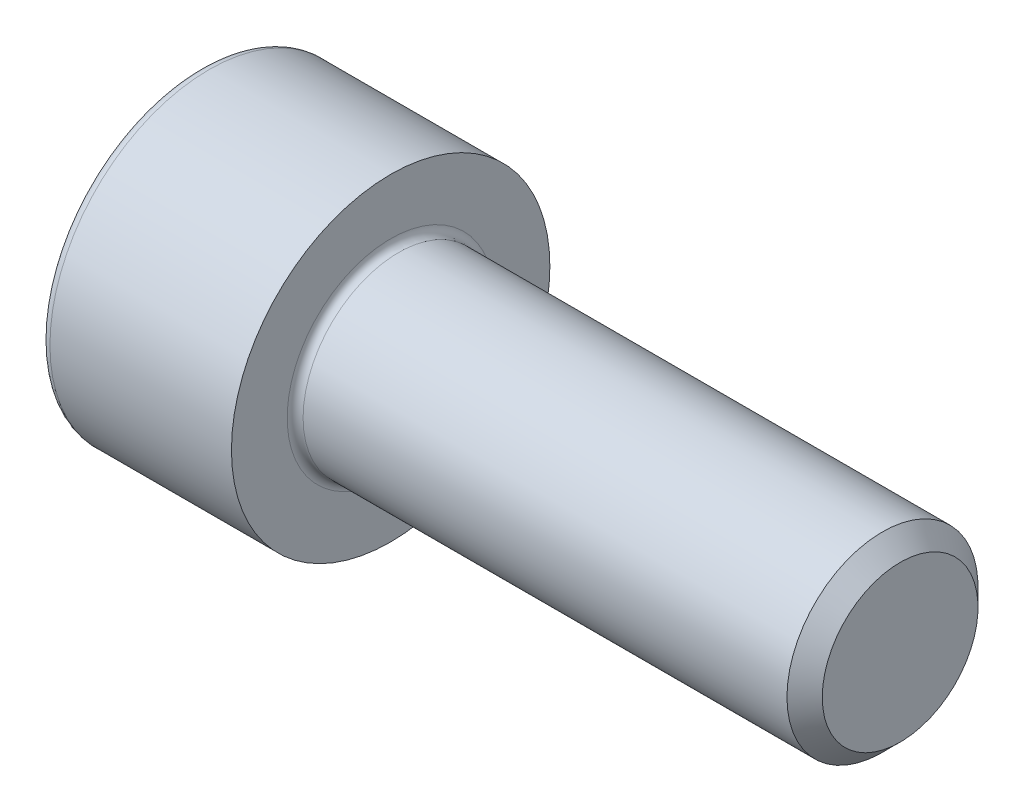
ISO-10303-21;
HEADER;
FILE_DESCRIPTION(('STEP AP214'),'2;1');
FILE_NAME('part.step','',(''),(''),'','','');
FILE_SCHEMA(('AUTOMOTIVE_DESIGN { 1 0 10303 214 1 1 1 1 }'));
ENDSEC;
DATA;
#1=APPLICATION_CONTEXT('core data for automotive mechanical design processes');
#2=APPLICATION_PROTOCOL_DEFINITION('international standard','automotive_design',2000,#1);
#3=PRODUCT_CONTEXT('',#1,'mechanical');
#4=PRODUCT('Part','Part','',(#3));
#5=PRODUCT_RELATED_PRODUCT_CATEGORY('part','',(#4));
#6=PRODUCT_DEFINITION_FORMATION('','',#4);
#7=PRODUCT_DEFINITION_CONTEXT('part definition',#1,'design');
#8=PRODUCT_DEFINITION('design','',#6,#7);
#9=PRODUCT_DEFINITION_SHAPE('','',#8);
#10=(LENGTH_UNIT() NAMED_UNIT(*) SI_UNIT(.MILLI.,.METRE.));
#11=(NAMED_UNIT(*) PLANE_ANGLE_UNIT() SI_UNIT($,.RADIAN.));
#12=(NAMED_UNIT(*) SI_UNIT($,.STERADIAN.) SOLID_ANGLE_UNIT());
#13=UNCERTAINTY_MEASURE_WITH_UNIT(LENGTH_MEASURE(1.E-05),#10,'distance_accuracy_value','');
#14=(GEOMETRIC_REPRESENTATION_CONTEXT(3) GLOBAL_UNCERTAINTY_ASSIGNED_CONTEXT((#13)) GLOBAL_UNIT_ASSIGNED_CONTEXT((#10,
#11,#12)) REPRESENTATION_CONTEXT('',''));
#15=CARTESIAN_POINT('',(0.,0.,0.));
#16=DIRECTION('',(0.,0.,1.));
#17=DIRECTION('',(1.,0.,0.));
#18=AXIS2_PLACEMENT_3D('',#15,#16,#17);
#19=CARTESIAN_POINT('',(0.,0.,0.));
#20=DIRECTION('',(-1.,0.,0.));
#21=DIRECTION('',(0.,0.,1.));
#22=AXIS2_PLACEMENT_3D('',#19,#20,#21);
#23=PLANE('',#22);
#24=DIRECTION('',(0.,-0.499999999999999,0.866025403784439));
#25=VECTOR('',#24,1.);
#26=CARTESIAN_POINT('',(0.,2.93524876856005,0.));
#27=LINE('',#26,#25);
#28=CARTESIAN_POINT('',(0.,2.93524876856005,0.));
#29=VERTEX_POINT('',#28);
#30=CARTESIAN_POINT('',(0.,1.46762438428003,2.542));
#31=VERTEX_POINT('',#30);
#32=EDGE_CURVE('E263',#29,#31,#27,.T.);
#33=ORIENTED_EDGE('',*,*,#32,.T.);
#34=DIRECTION('',(0.,1.,0.));
#35=VECTOR('',#34,1.);
#36=CARTESIAN_POINT('',(0.,-1.46762438428003,2.542));
#37=LINE('',#36,#35);
#38=CARTESIAN_POINT('',(0.,-1.46762438428003,2.542));
#39=VERTEX_POINT('',#38);
#40=EDGE_CURVE('E124',#39,#31,#37,.T.);
#41=ORIENTED_EDGE('',*,*,#40,.F.);
#42=DIRECTION('',(0.,-0.500000000000001,-0.866025403784438));
#43=VECTOR('',#42,1.);
#44=CARTESIAN_POINT('',(0.,-1.46762438428003,2.542));
#45=LINE('',#44,#43);
#46=CARTESIAN_POINT('',(0.,-2.93524876856006,0.));
#47=VERTEX_POINT('',#46);
#48=EDGE_CURVE('E266',#39,#47,#45,.T.);
#49=ORIENTED_EDGE('',*,*,#48,.T.);
#50=DIRECTION('',(0.,0.499999999999999,-0.866025403784439));
#51=VECTOR('',#50,1.);
#52=CARTESIAN_POINT('',(0.,-2.93524876856006,0.));
#53=LINE('',#52,#51);
#54=CARTESIAN_POINT('',(0.,-1.46762438428004,-2.542));
#55=VERTEX_POINT('',#54);
#56=EDGE_CURVE('E269',#47,#55,#53,.T.);
#57=ORIENTED_EDGE('',*,*,#56,.T.);
#58=DIRECTION('',(0.,-1.,0.));
#59=VECTOR('',#58,1.);
#60=CARTESIAN_POINT('',(0.,1.46762438428002,-2.542));
#61=LINE('',#60,#59);
#62=CARTESIAN_POINT('',(0.,1.46762438428002,-2.542));
#63=VERTEX_POINT('',#62);
#64=EDGE_CURVE('E272',#63,#55,#61,.T.);
#65=ORIENTED_EDGE('',*,*,#64,.F.);
#66=DIRECTION('',(0.,-0.500000000000001,-0.866025403784438));
#67=VECTOR('',#66,1.);
#68=CARTESIAN_POINT('',(0.,2.93524876856005,0.));
#69=LINE('',#68,#67);
#70=EDGE_CURVE('E119',#29,#63,#69,.T.);
#71=ORIENTED_EDGE('',*,*,#70,.F.);
#72=EDGE_LOOP('',(#33,#41,#49,#57,#65,#71));
#73=FACE_BOUND('',#72,.T.);
#74=CARTESIAN_POINT('',(0.,0.,0.));
#75=DIRECTION('',(-1.,0.,0.));
#76=DIRECTION('',(0.,0.,1.));
#77=AXIS2_PLACEMENT_3D('',#74,#75,#76);
#78=CIRCLE('',#77,4.7);
#79=CARTESIAN_POINT('',(0.,0.,4.7));
#80=VERTEX_POINT('',#79);
#81=EDGE_CURVE('E40',#80,#80,#78,.T.);
#82=ORIENTED_EDGE('',*,*,#81,.T.);
#83=EDGE_LOOP('',(#82));
#84=FACE_BOUND('',#83,.T.);
#85=ADVANCED_FACE('F32',(#73,#84),#23,.T.);
#86=CARTESIAN_POINT('',(-31.75,0.,0.));
#87=DIRECTION('',(-1.,0.,0.));
#88=DIRECTION('',(0.,0.,1.));
#89=AXIS2_PLACEMENT_3D('',#86,#87,#88);
#90=CYLINDRICAL_SURFACE('',#89,5.);
#91=CARTESIAN_POINT('',(0.300000000000002,0.,0.));
#92=DIRECTION('',(-1.,0.,0.));
#93=DIRECTION('',(0.,0.,1.));
#94=AXIS2_PLACEMENT_3D('',#91,#92,#93);
#95=CIRCLE('',#94,5.);
#96=CARTESIAN_POINT('',(0.300000000000002,0.,5.));
#97=VERTEX_POINT('',#96);
#98=EDGE_CURVE('E11',#97,#97,#95,.F.);
#99=ORIENTED_EDGE('',*,*,#98,.T.);
#100=EDGE_LOOP('',(#99));
#101=FACE_BOUND('',#100,.T.);
#102=CARTESIAN_POINT('',(6.,0.,0.));
#103=DIRECTION('',(-1.,0.,0.));
#104=DIRECTION('',(0.,0.,1.));
#105=AXIS2_PLACEMENT_3D('',#102,#103,#104);
#106=CIRCLE('',#105,5.);
#107=CARTESIAN_POINT('',(6.,0.,5.));
#108=VERTEX_POINT('',#107);
#109=EDGE_CURVE('E142',#108,#108,#106,.T.);
#110=ORIENTED_EDGE('',*,*,#109,.T.);
#111=EDGE_LOOP('',(#110));
#112=FACE_BOUND('',#111,.T.);
#113=ADVANCED_FACE('F166',(#101,#112),#90,.T.);
#114=CARTESIAN_POINT('',(6.,5.,0.));
#115=DIRECTION('',(1.,0.,0.));
#116=DIRECTION('',(0.,0.,-1.));
#117=AXIS2_PLACEMENT_3D('',#114,#115,#116);
#118=PLANE('',#117);
#119=CARTESIAN_POINT('',(6.,0.,0.));
#120=DIRECTION('',(1.,0.,0.));
#121=DIRECTION('',(0.,0.,-1.));
#122=AXIS2_PLACEMENT_3D('',#119,#120,#121);
#123=CIRCLE('',#122,3.25);
#124=CARTESIAN_POINT('',(6.,0.,-3.25));
#125=VERTEX_POINT('',#124);
#126=EDGE_CURVE('E145',#125,#125,#123,.F.);
#127=ORIENTED_EDGE('',*,*,#126,.T.);
#128=EDGE_LOOP('',(#127));
#129=FACE_BOUND('',#128,.T.);
#130=ORIENTED_EDGE('',*,*,#109,.F.);
#131=EDGE_LOOP('',(#130));
#132=FACE_BOUND('',#131,.T.);
#133=ADVANCED_FACE('F172',(#129,#132),#118,.T.);
#134=CARTESIAN_POINT('',(-31.75,0.,0.));
#135=DIRECTION('',(-1.,0.,0.));
#136=DIRECTION('',(0.,0.,1.));
#137=AXIS2_PLACEMENT_3D('',#134,#135,#136);
#138=CYLINDRICAL_SURFACE('',#137,3.);
#139=CARTESIAN_POINT('',(6.25,0.,0.));
#140=DIRECTION('',(1.,0.,0.));
#141=DIRECTION('',(0.,0.,-1.));
#142=AXIS2_PLACEMENT_3D('',#139,#140,#141);
#143=CIRCLE('',#142,3.);
#144=CARTESIAN_POINT('',(6.25,0.,-3.));
#145=VERTEX_POINT('',#144);
#146=EDGE_CURVE('E148',#145,#145,#143,.T.);
#147=ORIENTED_EDGE('',*,*,#146,.T.);
#148=EDGE_LOOP('',(#147));
#149=FACE_BOUND('',#148,.T.);
#150=CARTESIAN_POINT('',(21.4455,0.,0.));
#151=DIRECTION('',(-1.,0.,0.));
#152=DIRECTION('',(0.,0.,1.));
#153=AXIS2_PLACEMENT_3D('',#150,#151,#152);
#154=CIRCLE('',#153,3.);
#155=CARTESIAN_POINT('',(21.4455,0.,3.));
#156=VERTEX_POINT('',#155);
#157=EDGE_CURVE('E139',#156,#156,#154,.T.);
#158=ORIENTED_EDGE('',*,*,#157,.T.);
#159=EDGE_LOOP('',(#158));
#160=FACE_BOUND('',#159,.T.);
#161=ADVANCED_FACE('F178',(#149,#160),#138,.T.);
#162=CARTESIAN_POINT('',(22.,0.,0.));
#163=DIRECTION('',(-1.,0.,0.));
#164=DIRECTION('',(0.,0.,1.));
#165=AXIS2_PLACEMENT_3D('',#162,#163,#164);
#166=CONICAL_SURFACE('',#165,2.4455,0.785398163397461);
#167=ORIENTED_EDGE('',*,*,#157,.F.);
#168=EDGE_LOOP('',(#167));
#169=FACE_BOUND('',#168,.T.);
#170=CARTESIAN_POINT('',(22.,0.,0.));
#171=DIRECTION('',(-1.,0.,0.));
#172=DIRECTION('',(0.,0.,1.));
#173=AXIS2_PLACEMENT_3D('',#170,#171,#172);
#174=CIRCLE('',#173,2.4455);
#175=CARTESIAN_POINT('',(22.,0.,2.4455));
#176=VERTEX_POINT('',#175);
#177=EDGE_CURVE('E135',#176,#176,#174,.T.);
#178=ORIENTED_EDGE('',*,*,#177,.T.);
#179=EDGE_LOOP('',(#178));
#180=FACE_BOUND('',#179,.T.);
#181=ADVANCED_FACE('F182',(#169,#180),#166,.T.);
#182=CARTESIAN_POINT('',(22.,2.4455,0.));
#183=DIRECTION('',(1.,0.,0.));
#184=DIRECTION('',(0.,0.,-1.));
#185=AXIS2_PLACEMENT_3D('',#182,#183,#184);
#186=PLANE('',#185);
#187=ORIENTED_EDGE('',*,*,#177,.F.);
#188=EDGE_LOOP('',(#187));
#189=FACE_BOUND('',#188,.T.);
#190=ADVANCED_FACE('F162',(#189),#186,.T.);
#191=CARTESIAN_POINT('',(6.25,0.,0.));
#192=DIRECTION('',(1.,0.,0.));
#193=DIRECTION('',(0.,0.,-1.));
#194=AXIS2_PLACEMENT_3D('',#191,#192,#193);
#195=TOROIDAL_SURFACE('',#194,3.25,0.25);
#196=ORIENTED_EDGE('',*,*,#146,.F.);
#197=EDGE_LOOP('',(#196));
#198=FACE_BOUND('',#197,.T.);
#199=ORIENTED_EDGE('',*,*,#126,.F.);
#200=EDGE_LOOP('',(#199));
#201=FACE_BOUND('',#200,.T.);
#202=ADVANCED_FACE('F155',(#198,#201),#195,.F.);
#203=CARTESIAN_POINT('',(0.300000000000002,0.,0.));
#204=DIRECTION('',(-1.,0.,0.));
#205=DIRECTION('',(0.,0.,1.));
#206=AXIS2_PLACEMENT_3D('',#203,#204,#205);
#207=TOROIDAL_SURFACE('',#206,4.7,0.3);
#208=ORIENTED_EDGE('',*,*,#98,.F.);
#209=EDGE_LOOP('',(#208));
#210=FACE_BOUND('',#209,.T.);
#211=ORIENTED_EDGE('',*,*,#81,.F.);
#212=EDGE_LOOP('',(#211));
#213=FACE_BOUND('',#212,.T.);
#214=ADVANCED_FACE('F34',(#210,#213),#207,.T.);
#215=CARTESIAN_POINT('',(3.,2.93524876856005,0.));
#216=DIRECTION('',(0.,-0.866025403784439,-0.499999999999999));
#217=DIRECTION('',(0.,0.499999999999999,-0.866025403784439));
#218=AXIS2_PLACEMENT_3D('',#215,#216,#217);
#219=PLANE('',#218);
#220=ORIENTED_EDGE('',*,*,#32,.F.);
#221=DIRECTION('',(-1.,0.,0.));
#222=VECTOR('',#221,1.);
#223=CARTESIAN_POINT('',(3.,2.93524876856005,0.));
#224=LINE('',#223,#222);
#225=CARTESIAN_POINT('',(3.,2.93524876856005,0.));
#226=VERTEX_POINT('',#225);
#227=EDGE_CURVE('E262',#226,#29,#224,.T.);
#228=ORIENTED_EDGE('',*,*,#227,.F.);
#229=DIRECTION('',(0.,-0.499999999999999,0.866025403784439));
#230=VECTOR('',#229,1.);
#231=CARTESIAN_POINT('',(3.,2.93524876856005,0.));
#232=LINE('',#231,#230);
#233=CARTESIAN_POINT('',(3.,2.20143657642004,1.271));
#234=VERTEX_POINT('',#233);
#235=EDGE_CURVE('E47',#226,#234,#232,.T.);
#236=ORIENTED_EDGE('',*,*,#235,.T.);
#237=CARTESIAN_POINT('',(3.,1.46762438428003,2.542));
#238=VERTEX_POINT('',#237);
#239=EDGE_CURVE('E105',#234,#238,#232,.T.);
#240=ORIENTED_EDGE('',*,*,#239,.T.);
#241=DIRECTION('',(-1.,0.,0.));
#242=VECTOR('',#241,1.);
#243=CARTESIAN_POINT('',(3.,1.46762438428003,2.542));
#244=LINE('',#243,#242);
#245=EDGE_CURVE('E117',#238,#31,#244,.T.);
#246=ORIENTED_EDGE('',*,*,#245,.T.);
#247=EDGE_LOOP('',(#220,#228,#236,#240,#246));
#248=FACE_BOUND('',#247,.T.);
#249=ADVANCED_FACE('F116',(#248),#219,.T.);
#250=CARTESIAN_POINT('',(3.,-1.46762438428003,2.542));
#251=DIRECTION('',(0.,0.,1.));
#252=DIRECTION('',(0.,-1.,0.));
#253=AXIS2_PLACEMENT_3D('',#250,#251,#252);
#254=PLANE('',#253);
#255=ORIENTED_EDGE('',*,*,#40,.T.);
#256=ORIENTED_EDGE('',*,*,#245,.F.);
#257=DIRECTION('',(0.,1.,0.));
#258=VECTOR('',#257,1.);
#259=CARTESIAN_POINT('',(3.,-1.46762438428003,2.542));
#260=LINE('',#259,#258);
#261=CARTESIAN_POINT('',(3.,0.,2.542));
#262=VERTEX_POINT('',#261);
#263=EDGE_CURVE('E103',#262,#238,#260,.T.);
#264=ORIENTED_EDGE('',*,*,#263,.F.);
#265=CARTESIAN_POINT('',(3.,-1.46762438428003,2.542));
#266=VERTEX_POINT('',#265);
#267=EDGE_CURVE('E113',#266,#262,#260,.T.);
#268=ORIENTED_EDGE('',*,*,#267,.F.);
#269=DIRECTION('',(-1.,0.,0.));
#270=VECTOR('',#269,1.);
#271=CARTESIAN_POINT('',(3.,-1.46762438428003,2.542));
#272=LINE('',#271,#270);
#273=EDGE_CURVE('E126',#266,#39,#272,.T.);
#274=ORIENTED_EDGE('',*,*,#273,.T.);
#275=EDGE_LOOP('',(#255,#256,#264,#268,#274));
#276=FACE_BOUND('',#275,.T.);
#277=ADVANCED_FACE('F121',(#276),#254,.F.);
#278=CARTESIAN_POINT('',(3.,-1.46762438428003,2.542));
#279=DIRECTION('',(0.,0.866025403784438,-0.500000000000001));
#280=DIRECTION('',(0.,0.500000000000001,0.866025403784438));
#281=AXIS2_PLACEMENT_3D('',#278,#279,#280);
#282=PLANE('',#281);
#283=ORIENTED_EDGE('',*,*,#48,.F.);
#284=ORIENTED_EDGE('',*,*,#273,.F.);
#285=DIRECTION('',(0.,-0.500000000000001,-0.866025403784438));
#286=VECTOR('',#285,1.);
#287=CARTESIAN_POINT('',(3.,-1.46762438428003,2.542));
#288=LINE('',#287,#286);
#289=CARTESIAN_POINT('',(3.,-2.20143657642004,1.271));
#290=VERTEX_POINT('',#289);
#291=EDGE_CURVE('E243',#266,#290,#288,.T.);
#292=ORIENTED_EDGE('',*,*,#291,.T.);
#293=CARTESIAN_POINT('',(3.,-2.93524876856006,0.));
#294=VERTEX_POINT('',#293);
#295=EDGE_CURVE('E245',#290,#294,#288,.T.);
#296=ORIENTED_EDGE('',*,*,#295,.T.);
#297=DIRECTION('',(-1.,0.,0.));
#298=VECTOR('',#297,1.);
#299=CARTESIAN_POINT('',(3.,-2.93524876856006,0.));
#300=LINE('',#299,#298);
#301=EDGE_CURVE('E131',#294,#47,#300,.T.);
#302=ORIENTED_EDGE('',*,*,#301,.T.);
#303=EDGE_LOOP('',(#283,#284,#292,#296,#302));
#304=FACE_BOUND('',#303,.T.);
#305=ADVANCED_FACE('F195',(#304),#282,.T.);
#306=CARTESIAN_POINT('',(3.,-2.93524876856006,0.));
#307=DIRECTION('',(0.,0.866025403784439,0.499999999999999));
#308=DIRECTION('',(0.,-0.499999999999999,0.866025403784439));
#309=AXIS2_PLACEMENT_3D('',#306,#307,#308);
#310=PLANE('',#309);
#311=ORIENTED_EDGE('',*,*,#56,.F.);
#312=ORIENTED_EDGE('',*,*,#301,.F.);
#313=DIRECTION('',(0.,0.499999999999999,-0.866025403784439));
#314=VECTOR('',#313,1.);
#315=CARTESIAN_POINT('',(3.,-2.93524876856006,0.));
#316=LINE('',#315,#314);
#317=CARTESIAN_POINT('',(3.,-2.20143657642005,-1.271));
#318=VERTEX_POINT('',#317);
#319=EDGE_CURVE('E248',#294,#318,#316,.T.);
#320=ORIENTED_EDGE('',*,*,#319,.T.);
#321=CARTESIAN_POINT('',(3.,-1.46762438428004,-2.542));
#322=VERTEX_POINT('',#321);
#323=EDGE_CURVE('E252',#318,#322,#316,.T.);
#324=ORIENTED_EDGE('',*,*,#323,.T.);
#325=DIRECTION('',(-1.,0.,0.));
#326=VECTOR('',#325,1.);
#327=CARTESIAN_POINT('',(3.,-1.46762438428004,-2.542));
#328=LINE('',#327,#326);
#329=EDGE_CURVE('E281',#322,#55,#328,.T.);
#330=ORIENTED_EDGE('',*,*,#329,.T.);
#331=EDGE_LOOP('',(#311,#312,#320,#324,#330));
#332=FACE_BOUND('',#331,.T.);
#333=ADVANCED_FACE('F198',(#332),#310,.T.);
#334=CARTESIAN_POINT('',(3.,1.46762438428002,-2.542));
#335=DIRECTION('',(0.,0.,-1.));
#336=DIRECTION('',(0.,1.,0.));
#337=AXIS2_PLACEMENT_3D('',#334,#335,#336);
#338=PLANE('',#337);
#339=ORIENTED_EDGE('',*,*,#64,.T.);
#340=ORIENTED_EDGE('',*,*,#329,.F.);
#341=DIRECTION('',(0.,-1.,0.));
#342=VECTOR('',#341,1.);
#343=CARTESIAN_POINT('',(3.,1.46762438428002,-2.542));
#344=LINE('',#343,#342);
#345=CARTESIAN_POINT('',(3.,0.,-2.542));
#346=VERTEX_POINT('',#345);
#347=EDGE_CURVE('E256',#346,#322,#344,.T.);
#348=ORIENTED_EDGE('',*,*,#347,.F.);
#349=CARTESIAN_POINT('',(3.,1.46762438428002,-2.542));
#350=VERTEX_POINT('',#349);
#351=EDGE_CURVE('E257',#350,#346,#344,.T.);
#352=ORIENTED_EDGE('',*,*,#351,.F.);
#353=DIRECTION('',(-1.,0.,0.));
#354=VECTOR('',#353,1.);
#355=CARTESIAN_POINT('',(3.,1.46762438428002,-2.542));
#356=LINE('',#355,#354);
#357=EDGE_CURVE('E278',#350,#63,#356,.T.);
#358=ORIENTED_EDGE('',*,*,#357,.T.);
#359=EDGE_LOOP('',(#339,#340,#348,#352,#358));
#360=FACE_BOUND('',#359,.T.);
#361=ADVANCED_FACE('F202',(#360),#338,.F.);
#362=CARTESIAN_POINT('',(3.,2.93524876856005,0.));
#363=DIRECTION('',(0.,0.866025403784438,-0.500000000000001));
#364=DIRECTION('',(0.,0.500000000000001,0.866025403784438));
#365=AXIS2_PLACEMENT_3D('',#362,#363,#364);
#366=PLANE('',#365);
#367=ORIENTED_EDGE('',*,*,#70,.T.);
#368=ORIENTED_EDGE('',*,*,#357,.F.);
#369=DIRECTION('',(0.,-0.500000000000001,-0.866025403784438));
#370=VECTOR('',#369,1.);
#371=CARTESIAN_POINT('',(3.,2.93524876856005,0.));
#372=LINE('',#371,#370);
#373=CARTESIAN_POINT('',(3.,2.20143657642004,-1.271));
#374=VERTEX_POINT('',#373);
#375=EDGE_CURVE('E260',#374,#350,#372,.T.);
#376=ORIENTED_EDGE('',*,*,#375,.F.);
#377=EDGE_CURVE('E234',#226,#374,#372,.T.);
#378=ORIENTED_EDGE('',*,*,#377,.F.);
#379=ORIENTED_EDGE('',*,*,#227,.T.);
#380=EDGE_LOOP('',(#367,#368,#376,#378,#379));
#381=FACE_BOUND('',#380,.T.);
#382=ADVANCED_FACE('F206',(#381),#366,.F.);
#383=CARTESIAN_POINT('',(3.,1.46762438428003,2.542));
#384=DIRECTION('',(-1.,0.,0.));
#385=DIRECTION('',(0.,0.,1.));
#386=AXIS2_PLACEMENT_3D('',#383,#384,#385);
#387=PLANE('',#386);
#388=CARTESIAN_POINT('',(3.,0.,0.));
#389=DIRECTION('',(-1.,0.,0.));
#390=DIRECTION('',(0.,0.,1.));
#391=AXIS2_PLACEMENT_3D('',#388,#389,#390);
#392=CIRCLE('',#391,2.542);
#393=EDGE_CURVE('E125',#290,#262,#392,.T.);
#394=ORIENTED_EDGE('',*,*,#393,.F.);
#395=ORIENTED_EDGE('',*,*,#291,.F.);
#396=ORIENTED_EDGE('',*,*,#267,.T.);
#397=EDGE_LOOP('',(#394,#395,#396));
#398=FACE_BOUND('',#397,.T.);
#399=ADVANCED_FACE('F210',(#398),#387,.T.);
#400=EDGE_CURVE('E129',#318,#290,#392,.T.);
#401=ORIENTED_EDGE('',*,*,#400,.F.);
#402=ORIENTED_EDGE('',*,*,#319,.F.);
#403=ORIENTED_EDGE('',*,*,#295,.F.);
#404=EDGE_LOOP('',(#401,#402,#403));
#405=FACE_BOUND('',#404,.T.);
#406=ADVANCED_FACE('F213',(#405),#387,.T.);
#407=EDGE_CURVE('E287',#346,#318,#392,.T.);
#408=ORIENTED_EDGE('',*,*,#407,.F.);
#409=ORIENTED_EDGE('',*,*,#347,.T.);
#410=ORIENTED_EDGE('',*,*,#323,.F.);
#411=EDGE_LOOP('',(#408,#409,#410));
#412=FACE_BOUND('',#411,.T.);
#413=ADVANCED_FACE('F218',(#412),#387,.T.);
#414=EDGE_CURVE('E237',#374,#346,#392,.T.);
#415=ORIENTED_EDGE('',*,*,#414,.F.);
#416=ORIENTED_EDGE('',*,*,#375,.T.);
#417=ORIENTED_EDGE('',*,*,#351,.T.);
#418=EDGE_LOOP('',(#415,#416,#417));
#419=FACE_BOUND('',#418,.T.);
#420=ADVANCED_FACE('F225',(#419),#387,.T.);
#421=EDGE_CURVE('E136',#234,#374,#392,.T.);
#422=ORIENTED_EDGE('',*,*,#421,.F.);
#423=ORIENTED_EDGE('',*,*,#235,.F.);
#424=ORIENTED_EDGE('',*,*,#377,.T.);
#425=EDGE_LOOP('',(#422,#423,#424));
#426=FACE_BOUND('',#425,.T.);
#427=ADVANCED_FACE('F221',(#426),#387,.T.);
#428=EDGE_CURVE('E108',#262,#234,#392,.T.);
#429=ORIENTED_EDGE('',*,*,#428,.F.);
#430=ORIENTED_EDGE('',*,*,#263,.T.);
#431=ORIENTED_EDGE('',*,*,#239,.F.);
#432=EDGE_LOOP('',(#429,#430,#431));
#433=FACE_BOUND('',#432,.T.);
#434=ADVANCED_FACE('F104',(#433),#387,.T.);
#435=CARTESIAN_POINT('',(3.,0.,0.));
#436=DIRECTION('',(-1.,0.,0.));
#437=DIRECTION('',(0.,0.,1.));
#438=AXIS2_PLACEMENT_3D('',#435,#436,#437);
#439=CONICAL_SURFACE('',#438,2.542,1.04719755119659);
#440=CARTESIAN_POINT('',(4.46762438428005,0.,0.));
#441=VERTEX_POINT('',#440);
#442=VERTEX_LOOP('',#441);
#443=FACE_BOUND('',#442,.T.);
#444=ORIENTED_EDGE('',*,*,#428,.T.);
#445=ORIENTED_EDGE('',*,*,#421,.T.);
#446=ORIENTED_EDGE('',*,*,#414,.T.);
#447=ORIENTED_EDGE('',*,*,#407,.T.);
#448=ORIENTED_EDGE('',*,*,#400,.T.);
#449=ORIENTED_EDGE('',*,*,#393,.T.);
#450=EDGE_LOOP('',(#444,#445,#446,#447,#448,#449));
#451=FACE_BOUND('',#450,.T.);
#452=ADVANCED_FACE('F190',(#443,#451),#439,.F.);
#453=CLOSED_SHELL('',(#85,#113,#133,#161,#181,#190,#202,#214,#249,#277,#305,#333,#361,#382,#399,
#406,#413,#420,#427,#434,#452));
#454=MANIFOLD_SOLID_BREP('B2',#453);
#455=ADVANCED_BREP_SHAPE_REPRESENTATION('',(#18,#454),#14);
#456=SHAPE_DEFINITION_REPRESENTATION(#9,#455);
ENDSEC;
END-ISO-10303-21;
